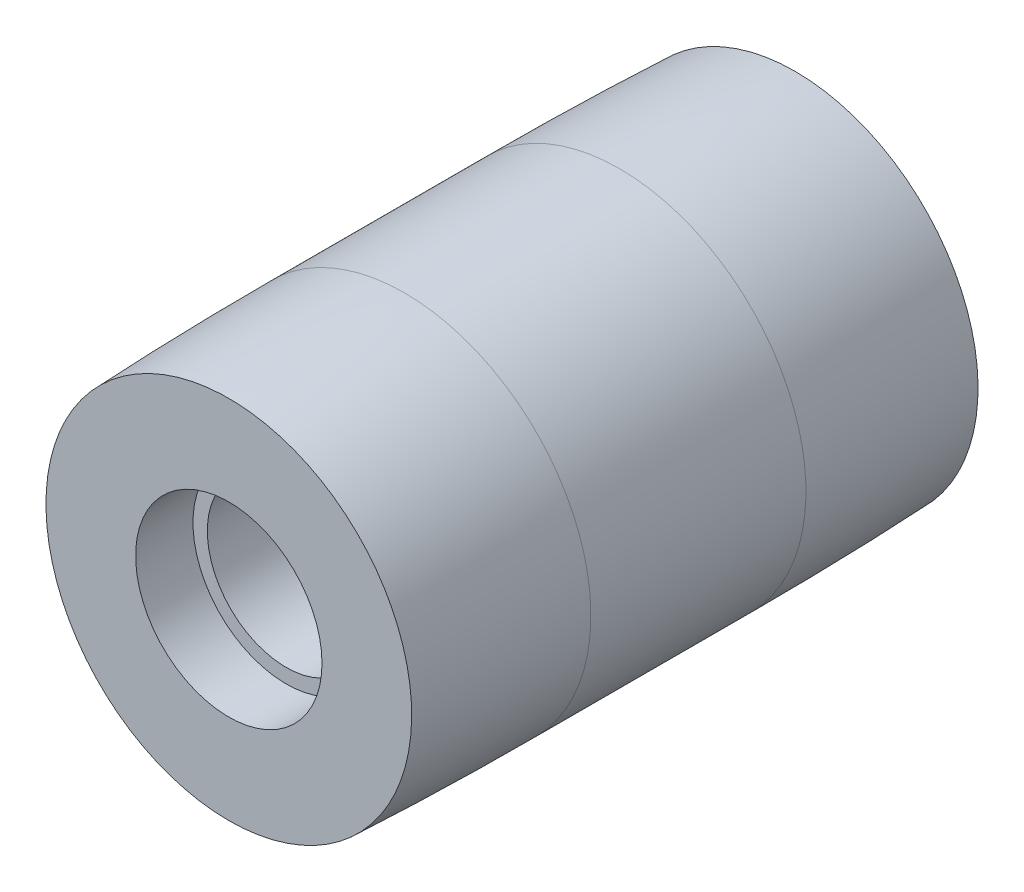
ISO-10303-21;
HEADER;
FILE_DESCRIPTION(('STEP AP214'),'2;1');
FILE_NAME('part.step','',(''),(''),'','','');
FILE_SCHEMA(('AUTOMOTIVE_DESIGN { 1 0 10303 214 1 1 1 1 }'));
ENDSEC;
DATA;
#1=APPLICATION_CONTEXT('core data for automotive mechanical design processes');
#2=APPLICATION_PROTOCOL_DEFINITION('international standard','automotive_design',2000,#1);
#3=PRODUCT_CONTEXT('',#1,'mechanical');
#4=PRODUCT('Part','Part','',(#3));
#5=PRODUCT_RELATED_PRODUCT_CATEGORY('part','',(#4));
#6=PRODUCT_DEFINITION_FORMATION('','',#4);
#7=PRODUCT_DEFINITION_CONTEXT('part definition',#1,'design');
#8=PRODUCT_DEFINITION('design','',#6,#7);
#9=PRODUCT_DEFINITION_SHAPE('','',#8);
#10=(LENGTH_UNIT() NAMED_UNIT(*) SI_UNIT(.MILLI.,.METRE.));
#11=(NAMED_UNIT(*) PLANE_ANGLE_UNIT() SI_UNIT($,.RADIAN.));
#12=(NAMED_UNIT(*) SI_UNIT($,.STERADIAN.) SOLID_ANGLE_UNIT());
#13=UNCERTAINTY_MEASURE_WITH_UNIT(LENGTH_MEASURE(1.E-05),#10,'distance_accuracy_value','');
#14=(GEOMETRIC_REPRESENTATION_CONTEXT(3) GLOBAL_UNCERTAINTY_ASSIGNED_CONTEXT((#13)) GLOBAL_UNIT_ASSIGNED_CONTEXT((#10,
#11,#12)) REPRESENTATION_CONTEXT('',''));
#15=CARTESIAN_POINT('',(0.,0.,0.));
#16=DIRECTION('',(0.,0.,1.));
#17=DIRECTION('',(1.,0.,0.));
#18=AXIS2_PLACEMENT_3D('',#15,#16,#17);
#19=CARTESIAN_POINT('',(0.,0.,0.));
#20=DIRECTION('',(0.,0.,1.));
#21=DIRECTION('',(1.,0.,0.));
#22=AXIS2_PLACEMENT_3D('',#19,#20,#21);
#23=CYLINDRICAL_SURFACE('',#22,11.);
#24=CARTESIAN_POINT('',(0.,0.,71.));
#25=DIRECTION('',(0.,0.,1.));
#26=DIRECTION('',(1.,0.,0.));
#27=AXIS2_PLACEMENT_3D('',#24,#25,#26);
#28=CIRCLE('',#27,11.);
#29=CARTESIAN_POINT('',(11.,0.,71.));
#30=VERTEX_POINT('',#29);
#31=EDGE_CURVE('E82',#30,#30,#28,.F.);
#32=ORIENTED_EDGE('',*,*,#31,.F.);
#33=EDGE_LOOP('',(#32));
#34=FACE_BOUND('',#33,.T.);
#35=CARTESIAN_POINT('',(0.,0.,8.));
#36=DIRECTION('',(0.,0.,-1.));
#37=DIRECTION('',(0.,1.,0.));
#38=AXIS2_PLACEMENT_3D('',#35,#36,#37);
#39=CIRCLE('',#38,11.);
#40=CARTESIAN_POINT('',(0.,11.,8.));
#41=VERTEX_POINT('',#40);
#42=EDGE_CURVE('E96',#41,#41,#39,.F.);
#43=ORIENTED_EDGE('',*,*,#42,.F.);
#44=EDGE_LOOP('',(#43));
#45=FACE_BOUND('',#44,.T.);
#46=ADVANCED_FACE('F53',(#34,#45),#23,.F.);
#47=CARTESIAN_POINT('',(0.,0.,0.));
#48=DIRECTION('',(0.,0.,-1.));
#49=DIRECTION('',(0.,1.,0.));
#50=AXIS2_PLACEMENT_3D('',#47,#48,#49);
#51=PLANE('',#50);
#52=CARTESIAN_POINT('',(0.,0.,0.));
#53=DIRECTION('',(0.,0.,-1.));
#54=DIRECTION('',(0.,1.,0.));
#55=AXIS2_PLACEMENT_3D('',#52,#53,#54);
#56=CIRCLE('',#55,13.);
#57=CARTESIAN_POINT('',(0.,13.,0.));
#58=VERTEX_POINT('',#57);
#59=EDGE_CURVE('E103',#58,#58,#56,.T.);
#60=ORIENTED_EDGE('',*,*,#59,.F.);
#61=EDGE_LOOP('',(#60));
#62=FACE_BOUND('',#61,.T.);
#63=CARTESIAN_POINT('',(0.,0.,0.));
#64=DIRECTION('',(0.,0.,-1.));
#65=DIRECTION('',(0.,1.,0.));
#66=AXIS2_PLACEMENT_3D('',#63,#64,#65);
#67=CIRCLE('',#66,25.504950474829);
#68=CARTESIAN_POINT('',(0.,25.504950474829,0.));
#69=VERTEX_POINT('',#68);
#70=EDGE_CURVE('E12',#69,#69,#67,.T.);
#71=ORIENTED_EDGE('',*,*,#70,.T.);
#72=EDGE_LOOP('',(#71));
#73=FACE_BOUND('',#72,.T.);
#74=ADVANCED_FACE('F113',(#62,#73),#51,.T.);
#75=CARTESIAN_POINT('',(0.,0.,24.5000000000079));
#76=DIRECTION('',(0.,0.,-1.));
#77=DIRECTION('',(0.,1.,0.));
#78=AXIS2_PLACEMENT_3D('',#75,#76,#77);
#79=DEGENERATE_TOROIDAL_SURFACE('',#78,580.500000000378,606.500000000378,.F.);
#80=CARTESIAN_POINT('',(0.,0.,24.4999999999999));
#81=DIRECTION('',(0.,0.,-1.));
#82=DIRECTION('',(0.,1.,0.));
#83=AXIS2_PLACEMENT_3D('',#80,#81,#82);
#84=CIRCLE('',#83,26.);
#85=CARTESIAN_POINT('',(0.,26.,24.4999999999999));
#86=VERTEX_POINT('',#85);
#87=EDGE_CURVE('E61',#86,#86,#84,.T.);
#88=ORIENTED_EDGE('',*,*,#87,.T.);
#89=EDGE_LOOP('',(#88));
#90=FACE_BOUND('',#89,.T.);
#91=ORIENTED_EDGE('',*,*,#70,.F.);
#92=EDGE_LOOP('',(#91));
#93=FACE_BOUND('',#92,.T.);
#94=ADVANCED_FACE('F55',(#90,#93),#79,.F.);
#95=CARTESIAN_POINT('',(0.,0.,0.));
#96=DIRECTION('',(0.,0.,-1.));
#97=DIRECTION('',(0.,1.,0.));
#98=AXIS2_PLACEMENT_3D('',#95,#96,#97);
#99=CYLINDRICAL_SURFACE('',#98,26.);
#100=CARTESIAN_POINT('',(0.,0.,54.5));
#101=DIRECTION('',(0.,0.,-1.));
#102=DIRECTION('',(0.,1.,0.));
#103=AXIS2_PLACEMENT_3D('',#100,#101,#102);
#104=CIRCLE('',#103,26.);
#105=CARTESIAN_POINT('',(0.,26.,54.5));
#106=VERTEX_POINT('',#105);
#107=EDGE_CURVE('E69',#106,#106,#104,.T.);
#108=ORIENTED_EDGE('',*,*,#107,.T.);
#109=EDGE_LOOP('',(#108));
#110=FACE_BOUND('',#109,.T.);
#111=ORIENTED_EDGE('',*,*,#87,.F.);
#112=EDGE_LOOP('',(#111));
#113=FACE_BOUND('',#112,.T.);
#114=ADVANCED_FACE('F120',(#110,#113),#99,.T.);
#115=CARTESIAN_POINT('',(0.,0.,54.5000000000031));
#116=DIRECTION('',(0.,0.,-1.));
#117=DIRECTION('',(0.,1.,0.));
#118=AXIS2_PLACEMENT_3D('',#115,#116,#117);
#119=DEGENERATE_TOROIDAL_SURFACE('',#118,580.499999999841,606.499999999841,.F.);
#120=CARTESIAN_POINT('',(0.,0.,79.));
#121=DIRECTION('',(0.,0.,1.));
#122=DIRECTION('',(0.,-1.,0.));
#123=AXIS2_PLACEMENT_3D('',#120,#121,#122);
#124=CIRCLE('',#123,25.5049504748289);
#125=CARTESIAN_POINT('',(0.,-25.5049504748289,79.));
#126=VERTEX_POINT('',#125);
#127=EDGE_CURVE('E77',#126,#126,#124,.F.);
#128=ORIENTED_EDGE('',*,*,#127,.T.);
#129=EDGE_LOOP('',(#128));
#130=FACE_BOUND('',#129,.T.);
#131=ORIENTED_EDGE('',*,*,#107,.F.);
#132=EDGE_LOOP('',(#131));
#133=FACE_BOUND('',#132,.T.);
#134=ADVANCED_FACE('F127',(#130,#133),#119,.F.);
#135=CARTESIAN_POINT('',(19.5,0.,79.));
#136=DIRECTION('',(0.,0.,1.));
#137=DIRECTION('',(0.,-1.,0.));
#138=AXIS2_PLACEMENT_3D('',#135,#136,#137);
#139=PLANE('',#138);
#140=CARTESIAN_POINT('',(0.,0.,79.));
#141=DIRECTION('',(0.,0.,1.));
#142=DIRECTION('',(1.,0.,0.));
#143=AXIS2_PLACEMENT_3D('',#140,#141,#142);
#144=CIRCLE('',#143,13.);
#145=CARTESIAN_POINT('',(13.,0.,79.));
#146=VERTEX_POINT('',#145);
#147=EDGE_CURVE('E93',#146,#146,#144,.T.);
#148=ORIENTED_EDGE('',*,*,#147,.F.);
#149=EDGE_LOOP('',(#148));
#150=FACE_BOUND('',#149,.T.);
#151=ORIENTED_EDGE('',*,*,#127,.F.);
#152=EDGE_LOOP('',(#151));
#153=FACE_BOUND('',#152,.T.);
#154=ADVANCED_FACE('F125',(#150,#153),#139,.T.);
#155=CARTESIAN_POINT('',(0.,0.,71.));
#156=DIRECTION('',(0.,0.,1.));
#157=DIRECTION('',(1.,0.,0.));
#158=AXIS2_PLACEMENT_3D('',#155,#156,#157);
#159=PLANE('',#158);
#160=CARTESIAN_POINT('',(0.,0.,71.));
#161=DIRECTION('',(0.,0.,1.));
#162=DIRECTION('',(1.,0.,0.));
#163=AXIS2_PLACEMENT_3D('',#160,#161,#162);
#164=CIRCLE('',#163,13.);
#165=CARTESIAN_POINT('',(13.,0.,71.));
#166=VERTEX_POINT('',#165);
#167=EDGE_CURVE('E88',#166,#166,#164,.T.);
#168=ORIENTED_EDGE('',*,*,#167,.T.);
#169=EDGE_LOOP('',(#168));
#170=FACE_BOUND('',#169,.T.);
#171=ORIENTED_EDGE('',*,*,#31,.T.);
#172=EDGE_LOOP('',(#171));
#173=FACE_BOUND('',#172,.T.);
#174=ADVANCED_FACE('F133',(#170,#173),#159,.T.);
#175=CARTESIAN_POINT('',(0.,0.,71.));
#176=DIRECTION('',(0.,0.,1.));
#177=DIRECTION('',(1.,0.,0.));
#178=AXIS2_PLACEMENT_3D('',#175,#176,#177);
#179=CYLINDRICAL_SURFACE('',#178,13.);
#180=ORIENTED_EDGE('',*,*,#167,.F.);
#181=EDGE_LOOP('',(#180));
#182=FACE_BOUND('',#181,.T.);
#183=ORIENTED_EDGE('',*,*,#147,.T.);
#184=EDGE_LOOP('',(#183));
#185=FACE_BOUND('',#184,.T.);
#186=ADVANCED_FACE('F141',(#182,#185),#179,.F.);
#187=CARTESIAN_POINT('',(0.,0.,8.));
#188=DIRECTION('',(0.,0.,-1.));
#189=DIRECTION('',(0.,1.,0.));
#190=AXIS2_PLACEMENT_3D('',#187,#188,#189);
#191=PLANE('',#190);
#192=CARTESIAN_POINT('',(0.,0.,8.));
#193=DIRECTION('',(0.,0.,-1.));
#194=DIRECTION('',(0.,1.,0.));
#195=AXIS2_PLACEMENT_3D('',#192,#193,#194);
#196=CIRCLE('',#195,13.);
#197=CARTESIAN_POINT('',(0.,13.,8.));
#198=VERTEX_POINT('',#197);
#199=EDGE_CURVE('E98',#198,#198,#196,.T.);
#200=ORIENTED_EDGE('',*,*,#199,.T.);
#201=EDGE_LOOP('',(#200));
#202=FACE_BOUND('',#201,.T.);
#203=ORIENTED_EDGE('',*,*,#42,.T.);
#204=EDGE_LOOP('',(#203));
#205=FACE_BOUND('',#204,.T.);
#206=ADVANCED_FACE('F148',(#202,#205),#191,.T.);
#207=CARTESIAN_POINT('',(0.,0.,8.));
#208=DIRECTION('',(0.,0.,-1.));
#209=DIRECTION('',(0.,1.,0.));
#210=AXIS2_PLACEMENT_3D('',#207,#208,#209);
#211=CYLINDRICAL_SURFACE('',#210,13.);
#212=ORIENTED_EDGE('',*,*,#199,.F.);
#213=EDGE_LOOP('',(#212));
#214=FACE_BOUND('',#213,.T.);
#215=ORIENTED_EDGE('',*,*,#59,.T.);
#216=EDGE_LOOP('',(#215));
#217=FACE_BOUND('',#216,.T.);
#218=ADVANCED_FACE('F111',(#214,#217),#211,.F.);
#219=CLOSED_SHELL('',(#46,#74,#94,#114,#134,#154,#174,#186,#206,#218));
#220=MANIFOLD_SOLID_BREP('B2',#219);
#221=ADVANCED_BREP_SHAPE_REPRESENTATION('',(#18,#220),#14);
#222=SHAPE_DEFINITION_REPRESENTATION(#9,#221);
ENDSEC;
END-ISO-10303-21;
